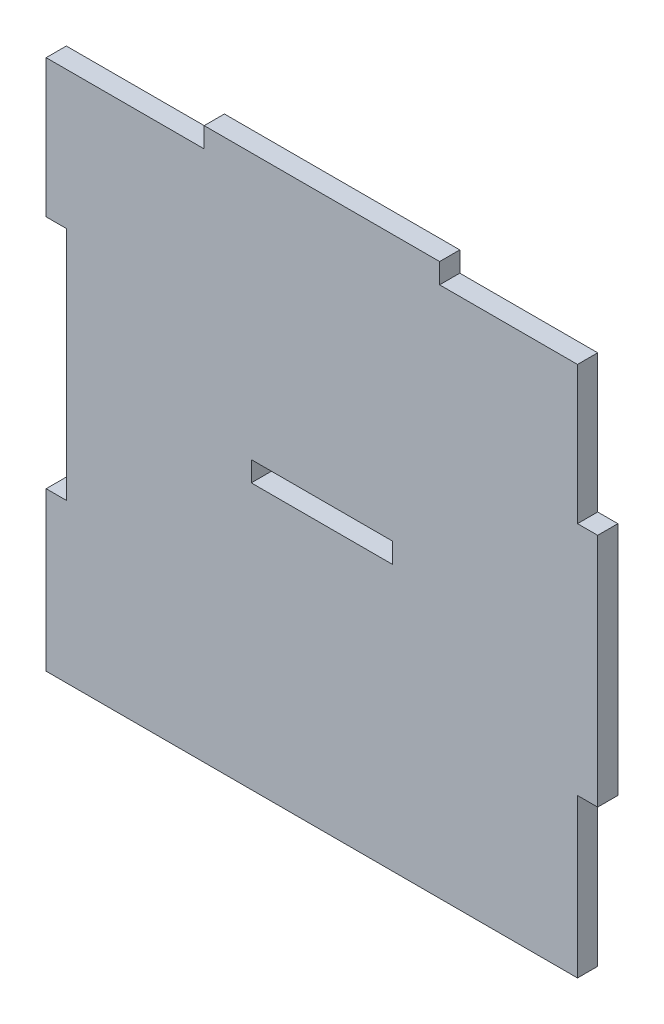
ISO-10303-21;
HEADER;
FILE_DESCRIPTION(('STEP AP214'),'2;1');
FILE_NAME('part.step','',(''),(''),'','','');
FILE_SCHEMA(('AUTOMOTIVE_DESIGN { 1 0 10303 214 1 1 1 1 }'));
ENDSEC;
DATA;
#1=APPLICATION_CONTEXT('core data for automotive mechanical design processes');
#2=APPLICATION_PROTOCOL_DEFINITION('international standard','automotive_design',2000,#1);
#3=PRODUCT_CONTEXT('',#1,'mechanical');
#4=PRODUCT('Part','Part','',(#3));
#5=PRODUCT_RELATED_PRODUCT_CATEGORY('part','',(#4));
#6=PRODUCT_DEFINITION_FORMATION('','',#4);
#7=PRODUCT_DEFINITION_CONTEXT('part definition',#1,'design');
#8=PRODUCT_DEFINITION('design','',#6,#7);
#9=PRODUCT_DEFINITION_SHAPE('','',#8);
#10=(LENGTH_UNIT() NAMED_UNIT(*) SI_UNIT(.MILLI.,.METRE.));
#11=(NAMED_UNIT(*) PLANE_ANGLE_UNIT() SI_UNIT($,.RADIAN.));
#12=(NAMED_UNIT(*) SI_UNIT($,.STERADIAN.) SOLID_ANGLE_UNIT());
#13=UNCERTAINTY_MEASURE_WITH_UNIT(LENGTH_MEASURE(1.E-05),#10,'distance_accuracy_value','');
#14=(GEOMETRIC_REPRESENTATION_CONTEXT(3) GLOBAL_UNCERTAINTY_ASSIGNED_CONTEXT((#13)) GLOBAL_UNIT_ASSIGNED_CONTEXT((#10,
#11,#12)) REPRESENTATION_CONTEXT('',''));
#15=CARTESIAN_POINT('',(0.,0.,0.));
#16=DIRECTION('',(0.,0.,1.));
#17=DIRECTION('',(1.,0.,0.));
#18=AXIS2_PLACEMENT_3D('',#15,#16,#17);
#19=CARTESIAN_POINT('',(38.,-16.,3.));
#20=DIRECTION('',(0.,1.,0.));
#21=DIRECTION('',(-1.,0.,0.));
#22=AXIS2_PLACEMENT_3D('',#19,#20,#21);
#23=PLANE('',#22);
#24=DIRECTION('',(1.,0.,0.));
#25=VECTOR('',#24,1.);
#26=CARTESIAN_POINT('',(38.,-16.,0.));
#27=LINE('',#26,#25);
#28=CARTESIAN_POINT('',(38.,-16.,0.));
#29=VERTEX_POINT('',#28);
#30=CARTESIAN_POINT('',(41.,-16.,0.));
#31=VERTEX_POINT('',#30);
#32=EDGE_CURVE('E218',#29,#31,#27,.T.);
#33=ORIENTED_EDGE('',*,*,#32,.T.);
#34=DIRECTION('',(0.,0.,-1.));
#35=VECTOR('',#34,1.);
#36=CARTESIAN_POINT('',(41.,-16.,3.));
#37=LINE('',#36,#35);
#38=CARTESIAN_POINT('',(41.,-16.,3.));
#39=VERTEX_POINT('',#38);
#40=EDGE_CURVE('E11',#39,#31,#37,.T.);
#41=ORIENTED_EDGE('',*,*,#40,.F.);
#42=DIRECTION('',(1.,0.,0.));
#43=VECTOR('',#42,1.);
#44=CARTESIAN_POINT('',(38.,-16.,3.));
#45=LINE('',#44,#43);
#46=CARTESIAN_POINT('',(38.,-16.,3.));
#47=VERTEX_POINT('',#46);
#48=EDGE_CURVE('E224',#47,#39,#45,.T.);
#49=ORIENTED_EDGE('',*,*,#48,.F.);
#50=DIRECTION('',(0.,0.,-1.));
#51=VECTOR('',#50,1.);
#52=CARTESIAN_POINT('',(38.,-16.,3.));
#53=LINE('',#52,#51);
#54=EDGE_CURVE('E274',#47,#29,#53,.T.);
#55=ORIENTED_EDGE('',*,*,#54,.T.);
#56=EDGE_LOOP('',(#33,#41,#49,#55));
#57=FACE_BOUND('',#56,.T.);
#58=ADVANCED_FACE('F38',(#57),#23,.F.);
#59=CARTESIAN_POINT('',(41.,16.,3.));
#60=DIRECTION('',(-1.,0.,0.));
#61=DIRECTION('',(0.,0.,1.));
#62=AXIS2_PLACEMENT_3D('',#59,#60,#61);
#63=PLANE('',#62);
#64=DIRECTION('',(0.,1.,0.));
#65=VECTOR('',#64,1.);
#66=CARTESIAN_POINT('',(41.,16.,0.));
#67=LINE('',#66,#65);
#68=CARTESIAN_POINT('',(41.,19.,0.));
#69=VERTEX_POINT('',#68);
#70=EDGE_CURVE('E278',#31,#69,#67,.T.);
#71=ORIENTED_EDGE('',*,*,#70,.T.);
#72=DIRECTION('',(0.,0.,-1.));
#73=VECTOR('',#72,1.);
#74=CARTESIAN_POINT('',(41.,19.,3.));
#75=LINE('',#74,#73);
#76=CARTESIAN_POINT('',(41.,19.,3.));
#77=VERTEX_POINT('',#76);
#78=EDGE_CURVE('E46',#77,#69,#75,.T.);
#79=ORIENTED_EDGE('',*,*,#78,.F.);
#80=DIRECTION('',(0.,1.,0.));
#81=VECTOR('',#80,1.);
#82=CARTESIAN_POINT('',(41.,16.,3.));
#83=LINE('',#82,#81);
#84=EDGE_CURVE('E228',#39,#77,#83,.T.);
#85=ORIENTED_EDGE('',*,*,#84,.F.);
#86=ORIENTED_EDGE('',*,*,#40,.T.);
#87=EDGE_LOOP('',(#71,#79,#85,#86));
#88=FACE_BOUND('',#87,.T.);
#89=ADVANCED_FACE('F407',(#88),#63,.F.);
#90=CARTESIAN_POINT('',(41.,19.,3.));
#91=DIRECTION('',(0.,-1.,0.));
#92=DIRECTION('',(0.,0.,-1.));
#93=AXIS2_PLACEMENT_3D('',#90,#91,#92);
#94=PLANE('',#93);
#95=DIRECTION('',(-1.,0.,0.));
#96=VECTOR('',#95,1.);
#97=CARTESIAN_POINT('',(41.,19.,0.));
#98=LINE('',#97,#96);
#99=CARTESIAN_POINT('',(38.,19.,0.));
#100=VERTEX_POINT('',#99);
#101=EDGE_CURVE('E281',#69,#100,#98,.T.);
#102=ORIENTED_EDGE('',*,*,#101,.T.);
#103=DIRECTION('',(0.,0.,-1.));
#104=VECTOR('',#103,1.);
#105=CARTESIAN_POINT('',(38.,19.,3.));
#106=LINE('',#105,#104);
#107=CARTESIAN_POINT('',(38.,19.,3.));
#108=VERTEX_POINT('',#107);
#109=EDGE_CURVE('E377',#108,#100,#106,.T.);
#110=ORIENTED_EDGE('',*,*,#109,.F.);
#111=DIRECTION('',(-1.,0.,0.));
#112=VECTOR('',#111,1.);
#113=CARTESIAN_POINT('',(41.,19.,3.));
#114=LINE('',#113,#112);
#115=EDGE_CURVE('E232',#77,#108,#114,.T.);
#116=ORIENTED_EDGE('',*,*,#115,.F.);
#117=ORIENTED_EDGE('',*,*,#78,.T.);
#118=EDGE_LOOP('',(#102,#110,#116,#117));
#119=FACE_BOUND('',#118,.T.);
#120=ADVANCED_FACE('F386',(#119),#94,.F.);
#121=CARTESIAN_POINT('',(38.,39.5,3.));
#122=DIRECTION('',(-1.,0.,0.));
#123=DIRECTION('',(0.,-1.,0.));
#124=AXIS2_PLACEMENT_3D('',#121,#122,#123);
#125=PLANE('',#124);
#126=DIRECTION('',(0.,1.,0.));
#127=VECTOR('',#126,1.);
#128=CARTESIAN_POINT('',(38.,39.5,0.));
#129=LINE('',#128,#127);
#130=CARTESIAN_POINT('',(38.,39.5,0.));
#131=VERTEX_POINT('',#130);
#132=EDGE_CURVE('E284',#100,#131,#129,.T.);
#133=ORIENTED_EDGE('',*,*,#132,.T.);
#134=DIRECTION('',(0.,0.,-1.));
#135=VECTOR('',#134,1.);
#136=CARTESIAN_POINT('',(38.,39.5,3.));
#137=LINE('',#136,#135);
#138=CARTESIAN_POINT('',(38.,39.5,3.));
#139=VERTEX_POINT('',#138);
#140=EDGE_CURVE('E373',#139,#131,#137,.T.);
#141=ORIENTED_EDGE('',*,*,#140,.F.);
#142=DIRECTION('',(0.,1.,0.));
#143=VECTOR('',#142,1.);
#144=CARTESIAN_POINT('',(38.,39.5,3.));
#145=LINE('',#144,#143);
#146=EDGE_CURVE('E235',#108,#139,#145,.T.);
#147=ORIENTED_EDGE('',*,*,#146,.F.);
#148=ORIENTED_EDGE('',*,*,#109,.T.);
#149=EDGE_LOOP('',(#133,#141,#147,#148));
#150=FACE_BOUND('',#149,.T.);
#151=ADVANCED_FACE('F395',(#150),#125,.F.);
#152=CARTESIAN_POINT('',(17.5,39.5,3.));
#153=DIRECTION('',(0.,-1.,0.));
#154=DIRECTION('',(1.,0.,0.));
#155=AXIS2_PLACEMENT_3D('',#152,#153,#154);
#156=PLANE('',#155);
#157=DIRECTION('',(-1.,0.,0.));
#158=VECTOR('',#157,1.);
#159=CARTESIAN_POINT('',(17.5,39.5,0.));
#160=LINE('',#159,#158);
#161=CARTESIAN_POINT('',(17.5,39.5,0.));
#162=VERTEX_POINT('',#161);
#163=EDGE_CURVE('E287',#131,#162,#160,.T.);
#164=ORIENTED_EDGE('',*,*,#163,.T.);
#165=DIRECTION('',(0.,0.,-1.));
#166=VECTOR('',#165,1.);
#167=CARTESIAN_POINT('',(17.5,39.5,3.));
#168=LINE('',#167,#166);
#169=CARTESIAN_POINT('',(17.5,39.5,3.));
#170=VERTEX_POINT('',#169);
#171=EDGE_CURVE('E369',#170,#162,#168,.T.);
#172=ORIENTED_EDGE('',*,*,#171,.F.);
#173=DIRECTION('',(-1.,0.,0.));
#174=VECTOR('',#173,1.);
#175=CARTESIAN_POINT('',(17.5,39.5,3.));
#176=LINE('',#175,#174);
#177=EDGE_CURVE('E238',#139,#170,#176,.T.);
#178=ORIENTED_EDGE('',*,*,#177,.F.);
#179=ORIENTED_EDGE('',*,*,#140,.T.);
#180=EDGE_LOOP('',(#164,#172,#178,#179));
#181=FACE_BOUND('',#180,.T.);
#182=ADVANCED_FACE('F399',(#181),#156,.F.);
#183=CARTESIAN_POINT('',(17.5,42.5,3.));
#184=DIRECTION('',(-1.,0.,0.));
#185=DIRECTION('',(0.,-1.,0.));
#186=AXIS2_PLACEMENT_3D('',#183,#184,#185);
#187=PLANE('',#186);
#188=DIRECTION('',(0.,1.,0.));
#189=VECTOR('',#188,1.);
#190=CARTESIAN_POINT('',(17.5,42.5,0.));
#191=LINE('',#190,#189);
#192=CARTESIAN_POINT('',(17.5,42.5,0.));
#193=VERTEX_POINT('',#192);
#194=EDGE_CURVE('E290',#162,#193,#191,.T.);
#195=ORIENTED_EDGE('',*,*,#194,.T.);
#196=DIRECTION('',(0.,0.,-1.));
#197=VECTOR('',#196,1.);
#198=CARTESIAN_POINT('',(17.5,42.5,3.));
#199=LINE('',#198,#197);
#200=CARTESIAN_POINT('',(17.5,42.5,3.));
#201=VERTEX_POINT('',#200);
#202=EDGE_CURVE('E365',#201,#193,#199,.T.);
#203=ORIENTED_EDGE('',*,*,#202,.F.);
#204=DIRECTION('',(0.,1.,0.));
#205=VECTOR('',#204,1.);
#206=CARTESIAN_POINT('',(17.5,42.5,3.));
#207=LINE('',#206,#205);
#208=EDGE_CURVE('E241',#170,#201,#207,.T.);
#209=ORIENTED_EDGE('',*,*,#208,.F.);
#210=ORIENTED_EDGE('',*,*,#171,.T.);
#211=EDGE_LOOP('',(#195,#203,#209,#210));
#212=FACE_BOUND('',#211,.T.);
#213=ADVANCED_FACE('F456',(#212),#187,.F.);
#214=CARTESIAN_POINT('',(-17.5,42.5,3.));
#215=DIRECTION('',(0.,-1.,0.));
#216=DIRECTION('',(0.,0.,-1.));
#217=AXIS2_PLACEMENT_3D('',#214,#215,#216);
#218=PLANE('',#217);
#219=DIRECTION('',(-1.,0.,0.));
#220=VECTOR('',#219,1.);
#221=CARTESIAN_POINT('',(-17.5,42.5,0.));
#222=LINE('',#221,#220);
#223=CARTESIAN_POINT('',(-17.5,42.5,0.));
#224=VERTEX_POINT('',#223);
#225=EDGE_CURVE('E293',#193,#224,#222,.T.);
#226=ORIENTED_EDGE('',*,*,#225,.T.);
#227=DIRECTION('',(0.,0.,-1.));
#228=VECTOR('',#227,1.);
#229=CARTESIAN_POINT('',(-17.5,42.5,3.));
#230=LINE('',#229,#228);
#231=CARTESIAN_POINT('',(-17.5,42.5,3.));
#232=VERTEX_POINT('',#231);
#233=EDGE_CURVE('E361',#232,#224,#230,.T.);
#234=ORIENTED_EDGE('',*,*,#233,.F.);
#235=DIRECTION('',(-1.,0.,0.));
#236=VECTOR('',#235,1.);
#237=CARTESIAN_POINT('',(-17.5,42.5,3.));
#238=LINE('',#237,#236);
#239=EDGE_CURVE('E244',#201,#232,#238,.T.);
#240=ORIENTED_EDGE('',*,*,#239,.F.);
#241=ORIENTED_EDGE('',*,*,#202,.T.);
#242=EDGE_LOOP('',(#226,#234,#240,#241));
#243=FACE_BOUND('',#242,.T.);
#244=ADVANCED_FACE('F454',(#243),#218,.F.);
#245=CARTESIAN_POINT('',(-17.5,39.5,3.));
#246=DIRECTION('',(1.,0.,0.));
#247=DIRECTION('',(0.,0.,-1.));
#248=AXIS2_PLACEMENT_3D('',#245,#246,#247);
#249=PLANE('',#248);
#250=DIRECTION('',(0.,-1.,0.));
#251=VECTOR('',#250,1.);
#252=CARTESIAN_POINT('',(-17.5,39.5,0.));
#253=LINE('',#252,#251);
#254=CARTESIAN_POINT('',(-17.5,39.5,0.));
#255=VERTEX_POINT('',#254);
#256=EDGE_CURVE('E296',#224,#255,#253,.T.);
#257=ORIENTED_EDGE('',*,*,#256,.T.);
#258=DIRECTION('',(0.,0.,-1.));
#259=VECTOR('',#258,1.);
#260=CARTESIAN_POINT('',(-17.5,39.5,3.));
#261=LINE('',#260,#259);
#262=CARTESIAN_POINT('',(-17.5,39.5,3.));
#263=VERTEX_POINT('',#262);
#264=EDGE_CURVE('E357',#263,#255,#261,.T.);
#265=ORIENTED_EDGE('',*,*,#264,.F.);
#266=DIRECTION('',(0.,-1.,0.));
#267=VECTOR('',#266,1.);
#268=CARTESIAN_POINT('',(-17.5,39.5,3.));
#269=LINE('',#268,#267);
#270=EDGE_CURVE('E247',#232,#263,#269,.T.);
#271=ORIENTED_EDGE('',*,*,#270,.F.);
#272=ORIENTED_EDGE('',*,*,#233,.T.);
#273=EDGE_LOOP('',(#257,#265,#271,#272));
#274=FACE_BOUND('',#273,.T.);
#275=ADVANCED_FACE('F447',(#274),#249,.F.);
#276=CARTESIAN_POINT('',(-41.,39.5,3.));
#277=DIRECTION('',(0.,-1.,0.));
#278=DIRECTION('',(0.,0.,-1.));
#279=AXIS2_PLACEMENT_3D('',#276,#277,#278);
#280=PLANE('',#279);
#281=DIRECTION('',(-1.,0.,0.));
#282=VECTOR('',#281,1.);
#283=CARTESIAN_POINT('',(-41.,39.5,0.));
#284=LINE('',#283,#282);
#285=CARTESIAN_POINT('',(-41.,39.5,0.));
#286=VERTEX_POINT('',#285);
#287=EDGE_CURVE('E300',#255,#286,#284,.T.);
#288=ORIENTED_EDGE('',*,*,#287,.T.);
#289=DIRECTION('',(0.,0.,-1.));
#290=VECTOR('',#289,1.);
#291=CARTESIAN_POINT('',(-41.,39.5,3.));
#292=LINE('',#291,#290);
#293=CARTESIAN_POINT('',(-41.,39.5,3.));
#294=VERTEX_POINT('',#293);
#295=EDGE_CURVE('E353',#294,#286,#292,.T.);
#296=ORIENTED_EDGE('',*,*,#295,.F.);
#297=DIRECTION('',(-1.,0.,0.));
#298=VECTOR('',#297,1.);
#299=CARTESIAN_POINT('',(-38.,39.5,3.));
#300=LINE('',#299,#298);
#301=EDGE_CURVE('E250',#263,#294,#300,.T.);
#302=ORIENTED_EDGE('',*,*,#301,.F.);
#303=ORIENTED_EDGE('',*,*,#264,.T.);
#304=EDGE_LOOP('',(#288,#296,#302,#303));
#305=FACE_BOUND('',#304,.T.);
#306=ADVANCED_FACE('F451',(#305),#280,.F.);
#307=CARTESIAN_POINT('',(-41.,19.,3.));
#308=DIRECTION('',(1.,0.,0.));
#309=DIRECTION('',(0.,1.,0.));
#310=AXIS2_PLACEMENT_3D('',#307,#308,#309);
#311=PLANE('',#310);
#312=DIRECTION('',(0.,-1.,0.));
#313=VECTOR('',#312,1.);
#314=CARTESIAN_POINT('',(-41.,19.,0.));
#315=LINE('',#314,#313);
#316=CARTESIAN_POINT('',(-41.,19.,0.));
#317=VERTEX_POINT('',#316);
#318=EDGE_CURVE('E303',#286,#317,#315,.T.);
#319=ORIENTED_EDGE('',*,*,#318,.T.);
#320=DIRECTION('',(0.,0.,-1.));
#321=VECTOR('',#320,1.);
#322=CARTESIAN_POINT('',(-41.,19.,3.));
#323=LINE('',#322,#321);
#324=CARTESIAN_POINT('',(-41.,19.,3.));
#325=VERTEX_POINT('',#324);
#326=EDGE_CURVE('E349',#325,#317,#323,.T.);
#327=ORIENTED_EDGE('',*,*,#326,.F.);
#328=DIRECTION('',(0.,-1.,0.));
#329=VECTOR('',#328,1.);
#330=CARTESIAN_POINT('',(-41.,19.,3.));
#331=LINE('',#330,#329);
#332=EDGE_CURVE('E253',#294,#325,#331,.T.);
#333=ORIENTED_EDGE('',*,*,#332,.F.);
#334=ORIENTED_EDGE('',*,*,#295,.T.);
#335=EDGE_LOOP('',(#319,#327,#333,#334));
#336=FACE_BOUND('',#335,.T.);
#337=ADVANCED_FACE('F440',(#336),#311,.F.);
#338=CARTESIAN_POINT('',(-38.,19.,3.));
#339=DIRECTION('',(0.,1.,0.));
#340=DIRECTION('',(-1.,0.,0.));
#341=AXIS2_PLACEMENT_3D('',#338,#339,#340);
#342=PLANE('',#341);
#343=DIRECTION('',(1.,0.,0.));
#344=VECTOR('',#343,1.);
#345=CARTESIAN_POINT('',(-38.,19.,0.));
#346=LINE('',#345,#344);
#347=CARTESIAN_POINT('',(-38.,19.,0.));
#348=VERTEX_POINT('',#347);
#349=EDGE_CURVE('E306',#317,#348,#346,.T.);
#350=ORIENTED_EDGE('',*,*,#349,.T.);
#351=DIRECTION('',(0.,0.,-1.));
#352=VECTOR('',#351,1.);
#353=CARTESIAN_POINT('',(-38.,19.,3.));
#354=LINE('',#353,#352);
#355=CARTESIAN_POINT('',(-38.,19.,3.));
#356=VERTEX_POINT('',#355);
#357=EDGE_CURVE('E345',#356,#348,#354,.T.);
#358=ORIENTED_EDGE('',*,*,#357,.F.);
#359=DIRECTION('',(1.,0.,0.));
#360=VECTOR('',#359,1.);
#361=CARTESIAN_POINT('',(-38.,19.,3.));
#362=LINE('',#361,#360);
#363=EDGE_CURVE('E256',#325,#356,#362,.T.);
#364=ORIENTED_EDGE('',*,*,#363,.F.);
#365=ORIENTED_EDGE('',*,*,#326,.T.);
#366=EDGE_LOOP('',(#350,#358,#364,#365));
#367=FACE_BOUND('',#366,.T.);
#368=ADVANCED_FACE('F435',(#367),#342,.F.);
#369=CARTESIAN_POINT('',(-38.,16.,3.));
#370=DIRECTION('',(1.,0.,0.));
#371=DIRECTION('',(0.,0.,-1.));
#372=AXIS2_PLACEMENT_3D('',#369,#370,#371);
#373=PLANE('',#372);
#374=DIRECTION('',(0.,-1.,0.));
#375=VECTOR('',#374,1.);
#376=CARTESIAN_POINT('',(-38.,16.,0.));
#377=LINE('',#376,#375);
#378=CARTESIAN_POINT('',(-38.,-16.,0.));
#379=VERTEX_POINT('',#378);
#380=EDGE_CURVE('E310',#348,#379,#377,.T.);
#381=ORIENTED_EDGE('',*,*,#380,.T.);
#382=DIRECTION('',(0.,0.,-1.));
#383=VECTOR('',#382,1.);
#384=CARTESIAN_POINT('',(-38.,-16.,3.));
#385=LINE('',#384,#383);
#386=CARTESIAN_POINT('',(-38.,-16.,3.));
#387=VERTEX_POINT('',#386);
#388=EDGE_CURVE('E341',#387,#379,#385,.T.);
#389=ORIENTED_EDGE('',*,*,#388,.F.);
#390=DIRECTION('',(0.,-1.,0.));
#391=VECTOR('',#390,1.);
#392=CARTESIAN_POINT('',(-38.,16.,3.));
#393=LINE('',#392,#391);
#394=EDGE_CURVE('E259',#356,#387,#393,.T.);
#395=ORIENTED_EDGE('',*,*,#394,.F.);
#396=ORIENTED_EDGE('',*,*,#357,.T.);
#397=EDGE_LOOP('',(#381,#389,#395,#396));
#398=FACE_BOUND('',#397,.T.);
#399=ADVANCED_FACE('F430',(#398),#373,.F.);
#400=CARTESIAN_POINT('',(-41.,-16.,3.));
#401=DIRECTION('',(0.,-1.,0.));
#402=DIRECTION('',(0.,0.,-1.));
#403=AXIS2_PLACEMENT_3D('',#400,#401,#402);
#404=PLANE('',#403);
#405=DIRECTION('',(-1.,0.,0.));
#406=VECTOR('',#405,1.);
#407=CARTESIAN_POINT('',(-41.,-16.,0.));
#408=LINE('',#407,#406);
#409=CARTESIAN_POINT('',(-41.,-16.,0.));
#410=VERTEX_POINT('',#409);
#411=EDGE_CURVE('E313',#379,#410,#408,.T.);
#412=ORIENTED_EDGE('',*,*,#411,.T.);
#413=DIRECTION('',(0.,0.,-1.));
#414=VECTOR('',#413,1.);
#415=CARTESIAN_POINT('',(-41.,-16.,3.));
#416=LINE('',#415,#414);
#417=CARTESIAN_POINT('',(-41.,-16.,3.));
#418=VERTEX_POINT('',#417);
#419=EDGE_CURVE('E337',#418,#410,#416,.T.);
#420=ORIENTED_EDGE('',*,*,#419,.F.);
#421=DIRECTION('',(-1.,0.,0.));
#422=VECTOR('',#421,1.);
#423=CARTESIAN_POINT('',(-41.,-16.,3.));
#424=LINE('',#423,#422);
#425=EDGE_CURVE('E262',#387,#418,#424,.T.);
#426=ORIENTED_EDGE('',*,*,#425,.F.);
#427=ORIENTED_EDGE('',*,*,#388,.T.);
#428=EDGE_LOOP('',(#412,#420,#426,#427));
#429=FACE_BOUND('',#428,.T.);
#430=ADVANCED_FACE('F426',(#429),#404,.F.);
#431=CARTESIAN_POINT('',(-41.,-19.,3.));
#432=DIRECTION('',(1.,0.,0.));
#433=DIRECTION('',(0.,1.,0.));
#434=AXIS2_PLACEMENT_3D('',#431,#432,#433);
#435=PLANE('',#434);
#436=DIRECTION('',(0.,-1.,0.));
#437=VECTOR('',#436,1.);
#438=CARTESIAN_POINT('',(-41.,-19.,0.));
#439=LINE('',#438,#437);
#440=CARTESIAN_POINT('',(-41.,-39.5,0.));
#441=VERTEX_POINT('',#440);
#442=EDGE_CURVE('E317',#410,#441,#439,.T.);
#443=ORIENTED_EDGE('',*,*,#442,.T.);
#444=DIRECTION('',(0.,0.,-1.));
#445=VECTOR('',#444,1.);
#446=CARTESIAN_POINT('',(-41.,-39.5,3.));
#447=LINE('',#446,#445);
#448=CARTESIAN_POINT('',(-41.,-39.5,3.));
#449=VERTEX_POINT('',#448);
#450=EDGE_CURVE('E333',#449,#441,#447,.T.);
#451=ORIENTED_EDGE('',*,*,#450,.F.);
#452=DIRECTION('',(0.,-1.,0.));
#453=VECTOR('',#452,1.);
#454=CARTESIAN_POINT('',(-41.,-19.,3.));
#455=LINE('',#454,#453);
#456=EDGE_CURVE('E265',#418,#449,#455,.T.);
#457=ORIENTED_EDGE('',*,*,#456,.F.);
#458=ORIENTED_EDGE('',*,*,#419,.T.);
#459=EDGE_LOOP('',(#443,#451,#457,#458));
#460=FACE_BOUND('',#459,.T.);
#461=ADVANCED_FACE('F423',(#460),#435,.F.);
#462=CARTESIAN_POINT('',(-41.,-39.5,3.));
#463=DIRECTION('',(0.,1.,0.));
#464=DIRECTION('',(0.,0.,1.));
#465=AXIS2_PLACEMENT_3D('',#462,#463,#464);
#466=PLANE('',#465);
#467=DIRECTION('',(1.,0.,0.));
#468=VECTOR('',#467,1.);
#469=CARTESIAN_POINT('',(-41.,-39.5,0.));
#470=LINE('',#469,#468);
#471=CARTESIAN_POINT('',(38.,-39.5,0.));
#472=VERTEX_POINT('',#471);
#473=EDGE_CURVE('E320',#441,#472,#470,.T.);
#474=ORIENTED_EDGE('',*,*,#473,.T.);
#475=DIRECTION('',(0.,0.,-1.));
#476=VECTOR('',#475,1.);
#477=CARTESIAN_POINT('',(38.,-39.5,3.));
#478=LINE('',#477,#476);
#479=CARTESIAN_POINT('',(38.,-39.5,3.));
#480=VERTEX_POINT('',#479);
#481=EDGE_CURVE('E329',#480,#472,#478,.T.);
#482=ORIENTED_EDGE('',*,*,#481,.F.);
#483=DIRECTION('',(1.,0.,0.));
#484=VECTOR('',#483,1.);
#485=CARTESIAN_POINT('',(-41.,-39.5,3.));
#486=LINE('',#485,#484);
#487=EDGE_CURVE('E268',#449,#480,#486,.T.);
#488=ORIENTED_EDGE('',*,*,#487,.F.);
#489=ORIENTED_EDGE('',*,*,#450,.T.);
#490=EDGE_LOOP('',(#474,#482,#488,#489));
#491=FACE_BOUND('',#490,.T.);
#492=ADVANCED_FACE('F414',(#491),#466,.F.);
#493=CARTESIAN_POINT('',(38.,-19.,3.));
#494=DIRECTION('',(-1.,0.,0.));
#495=DIRECTION('',(0.,-1.,0.));
#496=AXIS2_PLACEMENT_3D('',#493,#494,#495);
#497=PLANE('',#496);
#498=DIRECTION('',(0.,1.,0.));
#499=VECTOR('',#498,1.);
#500=CARTESIAN_POINT('',(38.,-19.,0.));
#501=LINE('',#500,#499);
#502=EDGE_CURVE('E229',#472,#29,#501,.T.);
#503=ORIENTED_EDGE('',*,*,#502,.T.);
#504=ORIENTED_EDGE('',*,*,#54,.F.);
#505=DIRECTION('',(0.,1.,0.));
#506=VECTOR('',#505,1.);
#507=CARTESIAN_POINT('',(38.,-19.,3.));
#508=LINE('',#507,#506);
#509=EDGE_CURVE('E271',#480,#47,#508,.T.);
#510=ORIENTED_EDGE('',*,*,#509,.F.);
#511=ORIENTED_EDGE('',*,*,#481,.T.);
#512=EDGE_LOOP('',(#503,#504,#510,#511));
#513=FACE_BOUND('',#512,.T.);
#514=ADVANCED_FACE('F418',(#513),#497,.F.);
#515=CARTESIAN_POINT('',(0.,0.,3.));
#516=DIRECTION('',(0.,0.,-1.));
#517=DIRECTION('',(-1.,0.,0.));
#518=AXIS2_PLACEMENT_3D('',#515,#516,#517);
#519=PLANE('',#518);
#520=DIRECTION('',(-1.,0.,0.));
#521=VECTOR('',#520,1.);
#522=CARTESIAN_POINT('',(-10.5,3.,3.));
#523=LINE('',#522,#521);
#524=CARTESIAN_POINT('',(10.5,3.,3.));
#525=VERTEX_POINT('',#524);
#526=CARTESIAN_POINT('',(-10.5,3.,3.));
#527=VERTEX_POINT('',#526);
#528=EDGE_CURVE('E209',#525,#527,#523,.T.);
#529=ORIENTED_EDGE('',*,*,#528,.F.);
#530=DIRECTION('',(0.,1.,0.));
#531=VECTOR('',#530,1.);
#532=CARTESIAN_POINT('',(10.5,3.,3.));
#533=LINE('',#532,#531);
#534=CARTESIAN_POINT('',(10.5,0.,3.));
#535=VERTEX_POINT('',#534);
#536=EDGE_CURVE('E53',#535,#525,#533,.T.);
#537=ORIENTED_EDGE('',*,*,#536,.F.);
#538=DIRECTION('',(1.,0.,0.));
#539=VECTOR('',#538,1.);
#540=CARTESIAN_POINT('',(-10.5,0.,3.));
#541=LINE('',#540,#539);
#542=CARTESIAN_POINT('',(-10.5,0.,3.));
#543=VERTEX_POINT('',#542);
#544=EDGE_CURVE('E196',#543,#535,#541,.T.);
#545=ORIENTED_EDGE('',*,*,#544,.F.);
#546=DIRECTION('',(0.,-1.,0.));
#547=VECTOR('',#546,1.);
#548=CARTESIAN_POINT('',(-10.5,3.,3.));
#549=LINE('',#548,#547);
#550=EDGE_CURVE('E200',#527,#543,#549,.T.);
#551=ORIENTED_EDGE('',*,*,#550,.F.);
#552=EDGE_LOOP('',(#529,#537,#545,#551));
#553=FACE_BOUND('',#552,.T.);
#554=ORIENTED_EDGE('',*,*,#48,.T.);
#555=ORIENTED_EDGE('',*,*,#84,.T.);
#556=ORIENTED_EDGE('',*,*,#115,.T.);
#557=ORIENTED_EDGE('',*,*,#146,.T.);
#558=ORIENTED_EDGE('',*,*,#177,.T.);
#559=ORIENTED_EDGE('',*,*,#208,.T.);
#560=ORIENTED_EDGE('',*,*,#239,.T.);
#561=ORIENTED_EDGE('',*,*,#270,.T.);
#562=ORIENTED_EDGE('',*,*,#301,.T.);
#563=ORIENTED_EDGE('',*,*,#332,.T.);
#564=ORIENTED_EDGE('',*,*,#363,.T.);
#565=ORIENTED_EDGE('',*,*,#394,.T.);
#566=ORIENTED_EDGE('',*,*,#425,.T.);
#567=ORIENTED_EDGE('',*,*,#456,.T.);
#568=ORIENTED_EDGE('',*,*,#487,.T.);
#569=ORIENTED_EDGE('',*,*,#509,.T.);
#570=EDGE_LOOP('',(#554,#555,#556,#557,#558,#559,#560,#561,#562,#563,#564,#565,#566,#567,#568,#569));
#571=FACE_BOUND('',#570,.T.);
#572=ADVANCED_FACE('F403',(#553,#571),#519,.F.);
#573=CARTESIAN_POINT('',(0.,0.,0.));
#574=DIRECTION('',(0.,0.,-1.));
#575=DIRECTION('',(-1.,0.,0.));
#576=AXIS2_PLACEMENT_3D('',#573,#574,#575);
#577=PLANE('',#576);
#578=DIRECTION('',(0.,1.,0.));
#579=VECTOR('',#578,1.);
#580=CARTESIAN_POINT('',(10.5,3.,0.));
#581=LINE('',#580,#579);
#582=CARTESIAN_POINT('',(10.5,0.,0.));
#583=VERTEX_POINT('',#582);
#584=CARTESIAN_POINT('',(10.5,3.,0.));
#585=VERTEX_POINT('',#584);
#586=EDGE_CURVE('E177',#583,#585,#581,.T.);
#587=ORIENTED_EDGE('',*,*,#586,.T.);
#588=DIRECTION('',(-1.,0.,0.));
#589=VECTOR('',#588,1.);
#590=CARTESIAN_POINT('',(-10.5,3.,0.));
#591=LINE('',#590,#589);
#592=CARTESIAN_POINT('',(-10.5,3.,0.));
#593=VERTEX_POINT('',#592);
#594=EDGE_CURVE('E187',#585,#593,#591,.T.);
#595=ORIENTED_EDGE('',*,*,#594,.T.);
#596=DIRECTION('',(0.,-1.,0.));
#597=VECTOR('',#596,1.);
#598=CARTESIAN_POINT('',(-10.5,3.,0.));
#599=LINE('',#598,#597);
#600=CARTESIAN_POINT('',(-10.5,0.,0.));
#601=VERTEX_POINT('',#600);
#602=EDGE_CURVE('E61',#593,#601,#599,.T.);
#603=ORIENTED_EDGE('',*,*,#602,.T.);
#604=DIRECTION('',(1.,0.,0.));
#605=VECTOR('',#604,1.);
#606=CARTESIAN_POINT('',(-10.5,0.,0.));
#607=LINE('',#606,#605);
#608=EDGE_CURVE('E184',#601,#583,#607,.T.);
#609=ORIENTED_EDGE('',*,*,#608,.T.);
#610=EDGE_LOOP('',(#587,#595,#603,#609));
#611=FACE_BOUND('',#610,.T.);
#612=ORIENTED_EDGE('',*,*,#32,.F.);
#613=ORIENTED_EDGE('',*,*,#502,.F.);
#614=ORIENTED_EDGE('',*,*,#473,.F.);
#615=ORIENTED_EDGE('',*,*,#442,.F.);
#616=ORIENTED_EDGE('',*,*,#411,.F.);
#617=ORIENTED_EDGE('',*,*,#380,.F.);
#618=ORIENTED_EDGE('',*,*,#349,.F.);
#619=ORIENTED_EDGE('',*,*,#318,.F.);
#620=ORIENTED_EDGE('',*,*,#287,.F.);
#621=ORIENTED_EDGE('',*,*,#256,.F.);
#622=ORIENTED_EDGE('',*,*,#225,.F.);
#623=ORIENTED_EDGE('',*,*,#194,.F.);
#624=ORIENTED_EDGE('',*,*,#163,.F.);
#625=ORIENTED_EDGE('',*,*,#132,.F.);
#626=ORIENTED_EDGE('',*,*,#101,.F.);
#627=ORIENTED_EDGE('',*,*,#70,.F.);
#628=EDGE_LOOP('',(#612,#613,#614,#615,#616,#617,#618,#619,#620,#621,#622,#623,#624,#625,#626,#627));
#629=FACE_BOUND('',#628,.T.);
#630=ADVANCED_FACE('F192',(#611,#629),#577,.T.);
#631=CARTESIAN_POINT('',(10.5,3.,0.));
#632=DIRECTION('',(1.,0.,0.));
#633=DIRECTION('',(0.,1.,0.));
#634=AXIS2_PLACEMENT_3D('',#631,#632,#633);
#635=PLANE('',#634);
#636=ORIENTED_EDGE('',*,*,#536,.T.);
#637=DIRECTION('',(0.,0.,1.));
#638=VECTOR('',#637,1.);
#639=CARTESIAN_POINT('',(10.5,3.,0.));
#640=LINE('',#639,#638);
#641=EDGE_CURVE('E173',#585,#525,#640,.T.);
#642=ORIENTED_EDGE('',*,*,#641,.F.);
#643=ORIENTED_EDGE('',*,*,#586,.F.);
#644=DIRECTION('',(0.,0.,1.));
#645=VECTOR('',#644,1.);
#646=CARTESIAN_POINT('',(10.5,0.,0.));
#647=LINE('',#646,#645);
#648=EDGE_CURVE('E215',#583,#535,#647,.T.);
#649=ORIENTED_EDGE('',*,*,#648,.T.);
#650=EDGE_LOOP('',(#636,#642,#643,#649));
#651=FACE_BOUND('',#650,.T.);
#652=ADVANCED_FACE('F175',(#651),#635,.F.);
#653=CARTESIAN_POINT('',(-10.5,0.,0.));
#654=DIRECTION('',(0.,-1.,0.));
#655=DIRECTION('',(0.,0.,-1.));
#656=AXIS2_PLACEMENT_3D('',#653,#654,#655);
#657=PLANE('',#656);
#658=ORIENTED_EDGE('',*,*,#544,.T.);
#659=ORIENTED_EDGE('',*,*,#648,.F.);
#660=ORIENTED_EDGE('',*,*,#608,.F.);
#661=DIRECTION('',(0.,0.,1.));
#662=VECTOR('',#661,1.);
#663=CARTESIAN_POINT('',(-10.5,0.,0.));
#664=LINE('',#663,#662);
#665=EDGE_CURVE('E219',#601,#543,#664,.T.);
#666=ORIENTED_EDGE('',*,*,#665,.T.);
#667=EDGE_LOOP('',(#658,#659,#660,#666));
#668=FACE_BOUND('',#667,.T.);
#669=ADVANCED_FACE('F591',(#668),#657,.F.);
#670=CARTESIAN_POINT('',(-10.5,3.,0.));
#671=DIRECTION('',(-1.,0.,0.));
#672=DIRECTION('',(0.,0.,1.));
#673=AXIS2_PLACEMENT_3D('',#670,#671,#672);
#674=PLANE('',#673);
#675=ORIENTED_EDGE('',*,*,#550,.T.);
#676=ORIENTED_EDGE('',*,*,#665,.F.);
#677=ORIENTED_EDGE('',*,*,#602,.F.);
#678=DIRECTION('',(0.,0.,1.));
#679=VECTOR('',#678,1.);
#680=CARTESIAN_POINT('',(-10.5,3.,0.));
#681=LINE('',#680,#679);
#682=EDGE_CURVE('E183',#593,#527,#681,.T.);
#683=ORIENTED_EDGE('',*,*,#682,.T.);
#684=EDGE_LOOP('',(#675,#676,#677,#683));
#685=FACE_BOUND('',#684,.T.);
#686=ADVANCED_FACE('F600',(#685),#674,.F.);
#687=CARTESIAN_POINT('',(-10.5,3.,0.));
#688=DIRECTION('',(0.,1.,0.));
#689=DIRECTION('',(0.,0.,1.));
#690=AXIS2_PLACEMENT_3D('',#687,#688,#689);
#691=PLANE('',#690);
#692=ORIENTED_EDGE('',*,*,#528,.T.);
#693=ORIENTED_EDGE('',*,*,#682,.F.);
#694=ORIENTED_EDGE('',*,*,#594,.F.);
#695=ORIENTED_EDGE('',*,*,#641,.T.);
#696=EDGE_LOOP('',(#692,#693,#694,#695));
#697=FACE_BOUND('',#696,.T.);
#698=ADVANCED_FACE('F188',(#697),#691,.F.);
#699=CLOSED_SHELL('',(#58,#89,#120,#151,#182,#213,#244,#275,#306,#337,#368,#399,#430,#461,#492,
#514,#572,#630,#652,#669,#686,#698));
#700=MANIFOLD_SOLID_BREP('B2',#699);
#701=ADVANCED_BREP_SHAPE_REPRESENTATION('',(#18,#700),#14);
#702=SHAPE_DEFINITION_REPRESENTATION(#9,#701);
ENDSEC;
END-ISO-10303-21;
